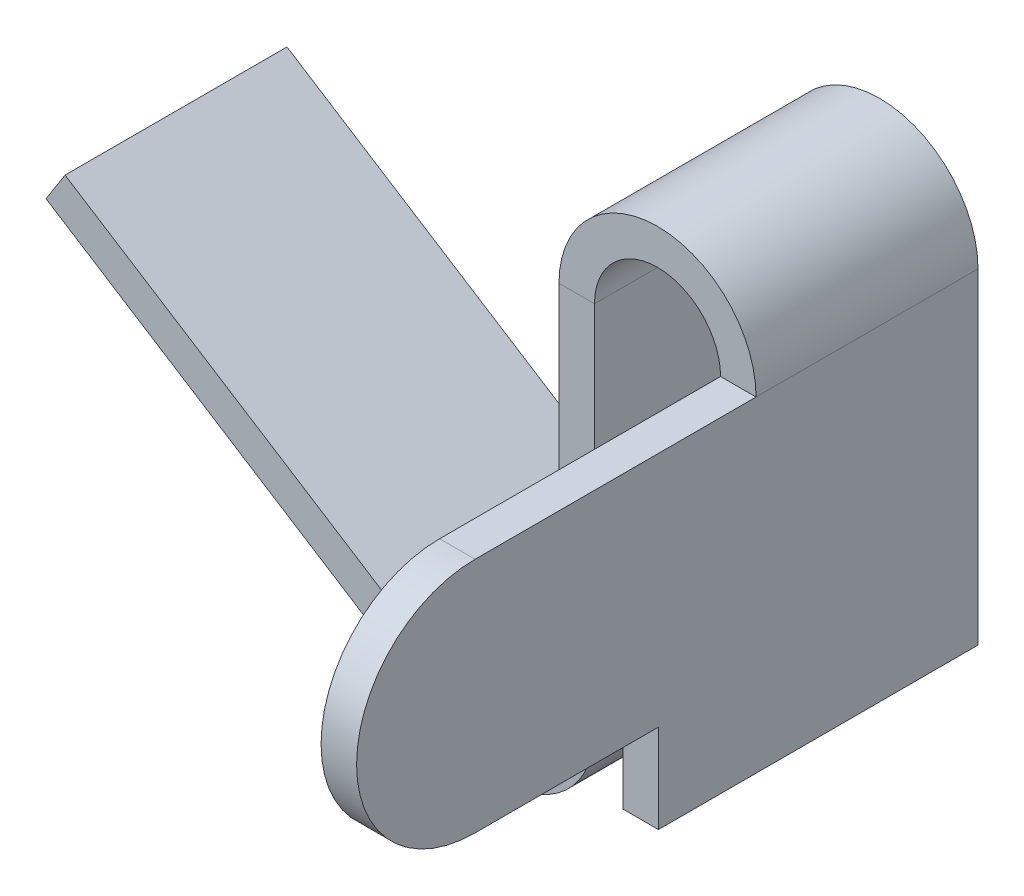
ISO-10303-21;
HEADER;
FILE_DESCRIPTION(('STEP AP214'),'2;1');
FILE_NAME('part.step','',(''),(''),'','','');
FILE_SCHEMA(('AUTOMOTIVE_DESIGN { 1 0 10303 214 1 1 1 1 }'));
ENDSEC;
DATA;
#1=APPLICATION_CONTEXT('core data for automotive mechanical design processes');
#2=APPLICATION_PROTOCOL_DEFINITION('international standard','automotive_design',2000,#1);
#3=PRODUCT_CONTEXT('',#1,'mechanical');
#4=PRODUCT('Part','Part','',(#3));
#5=PRODUCT_RELATED_PRODUCT_CATEGORY('part','',(#4));
#6=PRODUCT_DEFINITION_FORMATION('','',#4);
#7=PRODUCT_DEFINITION_CONTEXT('part definition',#1,'design');
#8=PRODUCT_DEFINITION('design','',#6,#7);
#9=PRODUCT_DEFINITION_SHAPE('','',#8);
#10=(LENGTH_UNIT() NAMED_UNIT(*) SI_UNIT(.MILLI.,.METRE.));
#11=(NAMED_UNIT(*) PLANE_ANGLE_UNIT() SI_UNIT($,.RADIAN.));
#12=(NAMED_UNIT(*) SI_UNIT($,.STERADIAN.) SOLID_ANGLE_UNIT());
#13=UNCERTAINTY_MEASURE_WITH_UNIT(LENGTH_MEASURE(1.E-05),#10,'distance_accuracy_value','');
#14=(GEOMETRIC_REPRESENTATION_CONTEXT(3) GLOBAL_UNCERTAINTY_ASSIGNED_CONTEXT((#13)) GLOBAL_UNIT_ASSIGNED_CONTEXT((#10,
#11,#12)) REPRESENTATION_CONTEXT('',''));
#15=CARTESIAN_POINT('',(0.,0.,0.));
#16=DIRECTION('',(0.,0.,1.));
#17=DIRECTION('',(1.,0.,0.));
#18=AXIS2_PLACEMENT_3D('',#15,#16,#17);
#19=CARTESIAN_POINT('',(1.11,0.5,5.665));
#20=DIRECTION('',(1.,0.,0.));
#21=DIRECTION('',(0.,1.,0.));
#22=AXIS2_PLACEMENT_3D('',#19,#20,#21);
#23=CYLINDRICAL_SURFACE('',#22,1.335);
#24=DIRECTION('',(-1.,0.,0.));
#25=VECTOR('',#24,1.);
#26=CARTESIAN_POINT('',(1.11,-0.835,5.665));
#27=LINE('',#26,#25);
#28=CARTESIAN_POINT('',(1.11,-0.835,5.665));
#29=VERTEX_POINT('',#28);
#30=CARTESIAN_POINT('',(0.71,-0.835,5.665));
#31=VERTEX_POINT('',#30);
#32=EDGE_CURVE('E212',#29,#31,#27,.T.);
#33=ORIENTED_EDGE('',*,*,#32,.F.);
#34=CARTESIAN_POINT('',(1.11,0.5,5.665));
#35=DIRECTION('',(-1.,0.,0.));
#36=DIRECTION('',(0.,-1.,0.));
#37=AXIS2_PLACEMENT_3D('',#34,#35,#36);
#38=CIRCLE('',#37,1.335);
#39=CARTESIAN_POINT('',(1.11,1.835,5.665));
#40=VERTEX_POINT('',#39);
#41=EDGE_CURVE('E55',#40,#29,#38,.F.);
#42=ORIENTED_EDGE('',*,*,#41,.F.);
#43=DIRECTION('',(-1.,0.,0.));
#44=VECTOR('',#43,1.);
#45=CARTESIAN_POINT('',(1.11,1.835,5.665));
#46=LINE('',#45,#44);
#47=CARTESIAN_POINT('',(0.709999999999999,1.835,5.665));
#48=VERTEX_POINT('',#47);
#49=EDGE_CURVE('E215',#48,#40,#46,.F.);
#50=ORIENTED_EDGE('',*,*,#49,.F.);
#51=CARTESIAN_POINT('',(0.709999999999999,0.5,5.665));
#52=DIRECTION('',(-1.,0.,0.));
#53=DIRECTION('',(0.,-1.,0.));
#54=AXIS2_PLACEMENT_3D('',#51,#52,#53);
#55=CIRCLE('',#54,1.335);
#56=EDGE_CURVE('E11',#31,#48,#55,.T.);
#57=ORIENTED_EDGE('',*,*,#56,.F.);
#58=EDGE_LOOP('',(#33,#42,#50,#57));
#59=FACE_BOUND('',#58,.T.);
#60=ADVANCED_FACE('F47',(#59),#23,.T.);
#61=CARTESIAN_POINT('',(-0.71,1.835,2.5));
#62=DIRECTION('',(0.,0.,1.));
#63=DIRECTION('',(1.,0.,0.));
#64=AXIS2_PLACEMENT_3D('',#61,#62,#63);
#65=PLANE('',#64);
#66=DIRECTION('',(-1.,0.,0.));
#67=VECTOR('',#66,1.);
#68=CARTESIAN_POINT('',(-0.71,1.835,2.5));
#69=LINE('',#68,#67);
#70=CARTESIAN_POINT('',(-0.71,1.835,2.5));
#71=VERTEX_POINT('',#70);
#72=CARTESIAN_POINT('',(-1.11,1.835,2.5));
#73=VERTEX_POINT('',#72);
#74=EDGE_CURVE('E210',#71,#73,#69,.T.);
#75=ORIENTED_EDGE('',*,*,#74,.F.);
#76=CARTESIAN_POINT('',(0.,1.835,2.5));
#77=DIRECTION('',(0.,0.,1.));
#78=DIRECTION('',(-1.,0.,0.));
#79=AXIS2_PLACEMENT_3D('',#76,#77,#78);
#80=CIRCLE('',#79,0.709999999999999);
#81=CARTESIAN_POINT('',(0.709999999999999,1.835,2.5));
#82=VERTEX_POINT('',#81);
#83=EDGE_CURVE('E250',#82,#71,#80,.T.);
#84=ORIENTED_EDGE('',*,*,#83,.F.);
#85=DIRECTION('',(-1.,0.,0.));
#86=VECTOR('',#85,1.);
#87=CARTESIAN_POINT('',(1.11,1.835,2.5));
#88=LINE('',#87,#86);
#89=CARTESIAN_POINT('',(1.11,1.835,2.5));
#90=VERTEX_POINT('',#89);
#91=EDGE_CURVE('E207',#90,#82,#88,.T.);
#92=ORIENTED_EDGE('',*,*,#91,.F.);
#93=CARTESIAN_POINT('',(0.,1.835,2.5));
#94=DIRECTION('',(0.,0.,1.));
#95=DIRECTION('',(1.,0.,0.));
#96=AXIS2_PLACEMENT_3D('',#93,#94,#95);
#97=CIRCLE('',#96,1.11);
#98=EDGE_CURVE('E253',#90,#73,#97,.T.);
#99=ORIENTED_EDGE('',*,*,#98,.T.);
#100=EDGE_LOOP('',(#75,#84,#92,#99));
#101=FACE_BOUND('',#100,.T.);
#102=ADVANCED_FACE('F356',(#101),#65,.T.);
#103=CARTESIAN_POINT('',(1.11,1.835,2.5));
#104=DIRECTION('',(0.,0.,1.));
#105=DIRECTION('',(1.,0.,0.));
#106=AXIS2_PLACEMENT_3D('',#103,#104,#105);
#107=PLANE('',#106);
#108=DIRECTION('',(0.,-1.,0.));
#109=VECTOR('',#108,1.);
#110=CARTESIAN_POINT('',(-0.709999999999999,-2.335,2.5));
#111=LINE('',#110,#109);
#112=CARTESIAN_POINT('',(-0.709999999999999,-2.335,2.5));
#113=VERTEX_POINT('',#112);
#114=EDGE_CURVE('E247',#71,#113,#111,.T.);
#115=ORIENTED_EDGE('',*,*,#114,.F.);
#116=ORIENTED_EDGE('',*,*,#74,.T.);
#117=DIRECTION('',(0.,-1.,0.));
#118=VECTOR('',#117,1.);
#119=CARTESIAN_POINT('',(-1.11,-1.835,2.5));
#120=LINE('',#119,#118);
#121=CARTESIAN_POINT('',(-1.11,-2.335,2.5));
#122=VERTEX_POINT('',#121);
#123=EDGE_CURVE('E256',#73,#122,#120,.T.);
#124=ORIENTED_EDGE('',*,*,#123,.T.);
#125=DIRECTION('',(1.,0.,0.));
#126=VECTOR('',#125,1.);
#127=CARTESIAN_POINT('',(-1.11,-2.335,2.5));
#128=LINE('',#127,#126);
#129=EDGE_CURVE('E199',#122,#113,#128,.T.);
#130=ORIENTED_EDGE('',*,*,#129,.T.);
#131=EDGE_LOOP('',(#115,#116,#124,#130));
#132=FACE_BOUND('',#131,.T.);
#133=ADVANCED_FACE('F351',(#132),#107,.T.);
#134=CARTESIAN_POINT('',(0.709999999999999,1.835,0.));
#135=DIRECTION('',(0.,0.,-1.));
#136=DIRECTION('',(-1.,0.,0.));
#137=AXIS2_PLACEMENT_3D('',#134,#135,#136);
#138=PLANE('',#137);
#139=DIRECTION('',(1.,0.,0.));
#140=VECTOR('',#139,1.);
#141=CARTESIAN_POINT('',(0.709999999999999,1.835,0.));
#142=LINE('',#141,#140);
#143=CARTESIAN_POINT('',(0.709999999999999,1.835,0.));
#144=VERTEX_POINT('',#143);
#145=CARTESIAN_POINT('',(1.11,1.835,0.));
#146=VERTEX_POINT('',#145);
#147=EDGE_CURVE('E205',#144,#146,#142,.T.);
#148=ORIENTED_EDGE('',*,*,#147,.F.);
#149=CARTESIAN_POINT('',(0.,1.835,0.));
#150=DIRECTION('',(0.,0.,1.));
#151=DIRECTION('',(-1.,0.,0.));
#152=AXIS2_PLACEMENT_3D('',#149,#150,#151);
#153=CIRCLE('',#152,0.709999999999999);
#154=CARTESIAN_POINT('',(-0.71,1.835,0.));
#155=VERTEX_POINT('',#154);
#156=EDGE_CURVE('E277',#144,#155,#153,.T.);
#157=ORIENTED_EDGE('',*,*,#156,.T.);
#158=DIRECTION('',(1.,0.,0.));
#159=VECTOR('',#158,1.);
#160=CARTESIAN_POINT('',(-1.11,1.835,0.));
#161=LINE('',#160,#159);
#162=CARTESIAN_POINT('',(-1.11,1.835,0.));
#163=VERTEX_POINT('',#162);
#164=EDGE_CURVE('E203',#163,#155,#161,.T.);
#165=ORIENTED_EDGE('',*,*,#164,.F.);
#166=CARTESIAN_POINT('',(0.,1.835,0.));
#167=DIRECTION('',(0.,0.,1.));
#168=DIRECTION('',(1.,0.,0.));
#169=AXIS2_PLACEMENT_3D('',#166,#167,#168);
#170=CIRCLE('',#169,1.11);
#171=EDGE_CURVE('E286',#146,#163,#170,.T.);
#172=ORIENTED_EDGE('',*,*,#171,.F.);
#173=EDGE_LOOP('',(#148,#157,#165,#172));
#174=FACE_BOUND('',#173,.T.);
#175=ADVANCED_FACE('F308',(#174),#138,.T.);
#176=CARTESIAN_POINT('',(-1.11,1.835,0.));
#177=DIRECTION('',(0.,0.,-1.));
#178=DIRECTION('',(-1.,0.,0.));
#179=AXIS2_PLACEMENT_3D('',#176,#177,#178);
#180=PLANE('',#179);
#181=DIRECTION('',(0.,1.,0.));
#182=VECTOR('',#181,1.);
#183=CARTESIAN_POINT('',(0.709999999999999,1.835,0.));
#184=LINE('',#183,#182);
#185=CARTESIAN_POINT('',(0.71,-1.835,0.));
#186=VERTEX_POINT('',#185);
#187=EDGE_CURVE('E173',#186,#144,#184,.T.);
#188=ORIENTED_EDGE('',*,*,#187,.T.);
#189=ORIENTED_EDGE('',*,*,#147,.T.);
#190=DIRECTION('',(0.,1.,0.));
#191=VECTOR('',#190,1.);
#192=CARTESIAN_POINT('',(1.11,1.835,0.));
#193=LINE('',#192,#191);
#194=CARTESIAN_POINT('',(1.11,-1.835,0.));
#195=VERTEX_POINT('',#194);
#196=EDGE_CURVE('E283',#195,#146,#193,.T.);
#197=ORIENTED_EDGE('',*,*,#196,.F.);
#198=DIRECTION('',(-1.,0.,0.));
#199=VECTOR('',#198,1.);
#200=CARTESIAN_POINT('',(1.11,-1.835,0.));
#201=LINE('',#200,#199);
#202=EDGE_CURVE('E281',#195,#186,#201,.T.);
#203=ORIENTED_EDGE('',*,*,#202,.T.);
#204=EDGE_LOOP('',(#188,#189,#197,#203));
#205=FACE_BOUND('',#204,.T.);
#206=ADVANCED_FACE('F365',(#205),#180,.T.);
#207=CARTESIAN_POINT('',(-2.24626881057681,-3.17904725152241,2.5));
#208=DIRECTION('',(0.,0.,1.));
#209=DIRECTION('',(1.,0.,0.));
#210=AXIS2_PLACEMENT_3D('',#207,#208,#209);
#211=PLANE('',#210);
#212=DIRECTION('',(0.536268810576813,0.844047251522407,0.));
#213=VECTOR('',#212,1.);
#214=CARTESIAN_POINT('',(-2.24626881057681,-3.17904725152241,2.5));
#215=LINE('',#214,#213);
#216=CARTESIAN_POINT('',(-2.24626881057681,-3.17904725152241,2.5));
#217=VERTEX_POINT('',#216);
#218=CARTESIAN_POINT('',(-2.03176128634609,-2.84142835091345,2.5));
#219=VERTEX_POINT('',#218);
#220=EDGE_CURVE('E201',#217,#219,#215,.T.);
#221=ORIENTED_EDGE('',*,*,#220,.F.);
#222=CARTESIAN_POINT('',(-1.71,-2.335,2.5));
#223=DIRECTION('',(0.,0.,-1.));
#224=DIRECTION('',(-1.,0.,0.));
#225=AXIS2_PLACEMENT_3D('',#222,#223,#224);
#226=CIRCLE('',#225,1.);
#227=EDGE_CURVE('E244',#113,#217,#226,.T.);
#228=ORIENTED_EDGE('',*,*,#227,.F.);
#229=ORIENTED_EDGE('',*,*,#129,.F.);
#230=CARTESIAN_POINT('',(-1.71,-2.335,2.5));
#231=DIRECTION('',(0.,0.,1.));
#232=DIRECTION('',(1.,0.,0.));
#233=AXIS2_PLACEMENT_3D('',#230,#231,#232);
#234=CIRCLE('',#233,0.6);
#235=EDGE_CURVE('E259',#122,#219,#234,.F.);
#236=ORIENTED_EDGE('',*,*,#235,.T.);
#237=EDGE_LOOP('',(#221,#228,#229,#236));
#238=FACE_BOUND('',#237,.T.);
#239=ADVANCED_FACE('F348',(#238),#211,.T.);
#240=CARTESIAN_POINT('',(-1.11,-2.335,2.5));
#241=DIRECTION('',(0.,0.,1.));
#242=DIRECTION('',(1.,0.,0.));
#243=AXIS2_PLACEMENT_3D('',#240,#241,#242);
#244=PLANE('',#243);
#245=DIRECTION('',(-0.844047251522408,0.536268810576813,0.));
#246=VECTOR('',#245,1.);
#247=CARTESIAN_POINT('',(-2.24626881057681,-3.17904725152241,2.5));
#248=LINE('',#247,#246);
#249=CARTESIAN_POINT('',(-6.88852869395005,-0.229568793349937,2.5));
#250=VERTEX_POINT('',#249);
#251=EDGE_CURVE('E241',#217,#250,#248,.T.);
#252=ORIENTED_EDGE('',*,*,#251,.F.);
#253=ORIENTED_EDGE('',*,*,#220,.T.);
#254=DIRECTION('',(-0.844047251522408,0.536268810576813,0.));
#255=VECTOR('',#254,1.);
#256=CARTESIAN_POINT('',(-2.03176128634609,-2.84142835091344,2.5));
#257=LINE('',#256,#255);
#258=CARTESIAN_POINT('',(-6.67402116971933,0.108050107259026,2.5));
#259=VERTEX_POINT('',#258);
#260=EDGE_CURVE('E235',#219,#259,#257,.T.);
#261=ORIENTED_EDGE('',*,*,#260,.T.);
#262=DIRECTION('',(0.536268810576814,0.844047251522407,0.));
#263=VECTOR('',#262,1.);
#264=CARTESIAN_POINT('',(-6.88852869395005,-0.229568793349937,2.5));
#265=LINE('',#264,#263);
#266=EDGE_CURVE('E237',#250,#259,#265,.T.);
#267=ORIENTED_EDGE('',*,*,#266,.F.);
#268=EDGE_LOOP('',(#252,#253,#261,#267));
#269=FACE_BOUND('',#268,.T.);
#270=ADVANCED_FACE('F346',(#269),#244,.T.);
#271=CARTESIAN_POINT('',(-0.709999999999999,-2.335,0.));
#272=DIRECTION('',(0.,0.,-1.));
#273=DIRECTION('',(-1.,0.,0.));
#274=AXIS2_PLACEMENT_3D('',#271,#272,#273);
#275=PLANE('',#274);
#276=DIRECTION('',(-1.,0.,0.));
#277=VECTOR('',#276,1.);
#278=CARTESIAN_POINT('',(-0.709999999999999,-2.335,0.));
#279=LINE('',#278,#277);
#280=CARTESIAN_POINT('',(-0.709999999999999,-2.335,0.));
#281=VERTEX_POINT('',#280);
#282=CARTESIAN_POINT('',(-1.11,-2.335,0.));
#283=VERTEX_POINT('',#282);
#284=EDGE_CURVE('E197',#281,#283,#279,.T.);
#285=ORIENTED_EDGE('',*,*,#284,.F.);
#286=CARTESIAN_POINT('',(-1.71,-2.335,0.));
#287=DIRECTION('',(0.,0.,-1.));
#288=DIRECTION('',(-1.,0.,0.));
#289=AXIS2_PLACEMENT_3D('',#286,#287,#288);
#290=CIRCLE('',#289,1.);
#291=CARTESIAN_POINT('',(-2.24626881057681,-3.17904725152241,0.));
#292=VERTEX_POINT('',#291);
#293=EDGE_CURVE('E271',#281,#292,#290,.T.);
#294=ORIENTED_EDGE('',*,*,#293,.T.);
#295=DIRECTION('',(-0.536268810576813,-0.844047251522407,0.));
#296=VECTOR('',#295,1.);
#297=CARTESIAN_POINT('',(-2.03176128634609,-2.84142835091345,0.));
#298=LINE('',#297,#296);
#299=CARTESIAN_POINT('',(-2.03176128634609,-2.84142835091345,0.));
#300=VERTEX_POINT('',#299);
#301=EDGE_CURVE('E195',#300,#292,#298,.T.);
#302=ORIENTED_EDGE('',*,*,#301,.F.);
#303=CARTESIAN_POINT('',(-1.71,-2.335,0.));
#304=DIRECTION('',(0.,0.,1.));
#305=DIRECTION('',(1.,0.,0.));
#306=AXIS2_PLACEMENT_3D('',#303,#304,#305);
#307=CIRCLE('',#306,0.6);
#308=EDGE_CURVE('E238',#283,#300,#307,.F.);
#309=ORIENTED_EDGE('',*,*,#308,.F.);
#310=EDGE_LOOP('',(#285,#294,#302,#309));
#311=FACE_BOUND('',#310,.T.);
#312=ADVANCED_FACE('F323',(#311),#275,.T.);
#313=CARTESIAN_POINT('',(-2.03176128634609,-2.84142835091345,0.));
#314=DIRECTION('',(0.,0.,-1.));
#315=DIRECTION('',(-1.,0.,0.));
#316=AXIS2_PLACEMENT_3D('',#313,#314,#315);
#317=PLANE('',#316);
#318=DIRECTION('',(0.,-1.,0.));
#319=VECTOR('',#318,1.);
#320=CARTESIAN_POINT('',(-0.709999999999999,-1.835,0.));
#321=LINE('',#320,#319);
#322=EDGE_CURVE('E274',#155,#281,#321,.T.);
#323=ORIENTED_EDGE('',*,*,#322,.T.);
#324=ORIENTED_EDGE('',*,*,#284,.T.);
#325=DIRECTION('',(0.,1.,0.));
#326=VECTOR('',#325,1.);
#327=CARTESIAN_POINT('',(-1.11,-2.335,0.));
#328=LINE('',#327,#326);
#329=EDGE_CURVE('E289',#163,#283,#328,.F.);
#330=ORIENTED_EDGE('',*,*,#329,.F.);
#331=ORIENTED_EDGE('',*,*,#164,.T.);
#332=EDGE_LOOP('',(#323,#324,#330,#331));
#333=FACE_BOUND('',#332,.T.);
#334=ADVANCED_FACE('F312',(#333),#317,.T.);
#335=CARTESIAN_POINT('',(-2.03176128634609,-2.84142835091344,2.5));
#336=DIRECTION('',(-0.536268810576813,-0.844047251522408,0.));
#337=DIRECTION('',(0.844047251522408,-0.536268810576813,0.));
#338=AXIS2_PLACEMENT_3D('',#335,#336,#337);
#339=PLANE('',#338);
#340=DIRECTION('',(-0.844047251522408,0.536268810576813,0.));
#341=VECTOR('',#340,1.);
#342=CARTESIAN_POINT('',(-2.03176128634609,-2.84142835091344,0.));
#343=LINE('',#342,#341);
#344=CARTESIAN_POINT('',(-6.67402116971933,0.108050107259026,0.));
#345=VERTEX_POINT('',#344);
#346=EDGE_CURVE('E234',#300,#345,#343,.T.);
#347=ORIENTED_EDGE('',*,*,#346,.T.);
#348=DIRECTION('',(0.,0.,-1.));
#349=VECTOR('',#348,1.);
#350=CARTESIAN_POINT('',(-6.67402116971933,0.108050107259026,2.5));
#351=LINE('',#350,#349);
#352=EDGE_CURVE('E193',#259,#345,#351,.T.);
#353=ORIENTED_EDGE('',*,*,#352,.F.);
#354=ORIENTED_EDGE('',*,*,#260,.F.);
#355=DIRECTION('',(0.,0.,-1.));
#356=VECTOR('',#355,1.);
#357=CARTESIAN_POINT('',(-2.03176128634609,-2.84142835091345,2.5));
#358=LINE('',#357,#356);
#359=EDGE_CURVE('E262',#219,#300,#358,.T.);
#360=ORIENTED_EDGE('',*,*,#359,.T.);
#361=EDGE_LOOP('',(#347,#353,#354,#360));
#362=FACE_BOUND('',#361,.T.);
#363=ADVANCED_FACE('F344',(#362),#339,.F.);
#364=CARTESIAN_POINT('',(-6.88852869395005,-0.229568793349937,2.5));
#365=DIRECTION('',(-0.844047251522407,0.536268810576814,0.));
#366=DIRECTION('',(-0.536268810576814,-0.844047251522407,0.));
#367=AXIS2_PLACEMENT_3D('',#364,#365,#366);
#368=PLANE('',#367);
#369=DIRECTION('',(0.536268810576814,0.844047251522407,0.));
#370=VECTOR('',#369,1.);
#371=CARTESIAN_POINT('',(-6.88852869395005,-0.229568793349937,0.));
#372=LINE('',#371,#370);
#373=CARTESIAN_POINT('',(-6.88852869395005,-0.229568793349937,0.));
#374=VERTEX_POINT('',#373);
#375=EDGE_CURVE('E265',#374,#345,#372,.T.);
#376=ORIENTED_EDGE('',*,*,#375,.F.);
#377=DIRECTION('',(0.,0.,-1.));
#378=VECTOR('',#377,1.);
#379=CARTESIAN_POINT('',(-6.88852869395005,-0.229568793349937,2.5));
#380=LINE('',#379,#378);
#381=EDGE_CURVE('E191',#250,#374,#380,.T.);
#382=ORIENTED_EDGE('',*,*,#381,.F.);
#383=ORIENTED_EDGE('',*,*,#266,.T.);
#384=ORIENTED_EDGE('',*,*,#352,.T.);
#385=EDGE_LOOP('',(#376,#382,#383,#384));
#386=FACE_BOUND('',#385,.T.);
#387=ADVANCED_FACE('F340',(#386),#368,.T.);
#388=CARTESIAN_POINT('',(-2.24626881057681,-3.17904725152241,2.5));
#389=DIRECTION('',(-0.536268810576813,-0.844047251522408,0.));
#390=DIRECTION('',(0.844047251522408,-0.536268810576813,0.));
#391=AXIS2_PLACEMENT_3D('',#388,#389,#390);
#392=PLANE('',#391);
#393=DIRECTION('',(-0.844047251522408,0.536268810576813,0.));
#394=VECTOR('',#393,1.);
#395=CARTESIAN_POINT('',(-2.24626881057681,-3.17904725152241,0.));
#396=LINE('',#395,#394);
#397=EDGE_CURVE('E268',#292,#374,#396,.T.);
#398=ORIENTED_EDGE('',*,*,#397,.F.);
#399=DIRECTION('',(0.,0.,-1.));
#400=VECTOR('',#399,1.);
#401=CARTESIAN_POINT('',(-2.24626881057681,-3.17904725152241,2.5));
#402=LINE('',#401,#400);
#403=EDGE_CURVE('E188',#217,#292,#402,.T.);
#404=ORIENTED_EDGE('',*,*,#403,.F.);
#405=ORIENTED_EDGE('',*,*,#251,.T.);
#406=ORIENTED_EDGE('',*,*,#381,.T.);
#407=EDGE_LOOP('',(#398,#404,#405,#406));
#408=FACE_BOUND('',#407,.T.);
#409=ADVANCED_FACE('F336',(#408),#392,.T.);
#410=CARTESIAN_POINT('',(-1.71,-2.335,2.5));
#411=DIRECTION('',(0.,0.,-1.));
#412=DIRECTION('',(-1.,0.,0.));
#413=AXIS2_PLACEMENT_3D('',#410,#411,#412);
#414=CYLINDRICAL_SURFACE('',#413,1.);
#415=ORIENTED_EDGE('',*,*,#293,.F.);
#416=DIRECTION('',(0.,0.,-1.));
#417=VECTOR('',#416,1.);
#418=CARTESIAN_POINT('',(-0.709999999999999,-2.335,2.5));
#419=LINE('',#418,#417);
#420=EDGE_CURVE('E185',#113,#281,#419,.T.);
#421=ORIENTED_EDGE('',*,*,#420,.F.);
#422=ORIENTED_EDGE('',*,*,#227,.T.);
#423=ORIENTED_EDGE('',*,*,#403,.T.);
#424=EDGE_LOOP('',(#415,#421,#422,#423));
#425=FACE_BOUND('',#424,.T.);
#426=ADVANCED_FACE('F331',(#425),#414,.T.);
#427=CARTESIAN_POINT('',(-0.709999999999999,-1.835,2.5));
#428=DIRECTION('',(1.,0.,0.));
#429=DIRECTION('',(0.,1.,0.));
#430=AXIS2_PLACEMENT_3D('',#427,#428,#429);
#431=PLANE('',#430);
#432=ORIENTED_EDGE('',*,*,#322,.F.);
#433=DIRECTION('',(0.,0.,-1.));
#434=VECTOR('',#433,1.);
#435=CARTESIAN_POINT('',(-0.71,1.835,2.5));
#436=LINE('',#435,#434);
#437=EDGE_CURVE('E177',#71,#155,#436,.T.);
#438=ORIENTED_EDGE('',*,*,#437,.F.);
#439=ORIENTED_EDGE('',*,*,#114,.T.);
#440=ORIENTED_EDGE('',*,*,#420,.T.);
#441=EDGE_LOOP('',(#432,#438,#439,#440));
#442=FACE_BOUND('',#441,.T.);
#443=ADVANCED_FACE('F471',(#442),#431,.T.);
#444=CARTESIAN_POINT('',(0.,1.835,2.5));
#445=DIRECTION('',(0.,0.,-1.));
#446=DIRECTION('',(-1.,0.,0.));
#447=AXIS2_PLACEMENT_3D('',#444,#445,#446);
#448=CYLINDRICAL_SURFACE('',#447,0.709999999999999);
#449=ORIENTED_EDGE('',*,*,#156,.F.);
#450=DIRECTION('',(0.,0.,-1.));
#451=VECTOR('',#450,1.);
#452=CARTESIAN_POINT('',(0.709999999999999,1.835,2.5));
#453=LINE('',#452,#451);
#454=EDGE_CURVE('E175',#82,#144,#453,.T.);
#455=ORIENTED_EDGE('',*,*,#454,.F.);
#456=ORIENTED_EDGE('',*,*,#83,.T.);
#457=ORIENTED_EDGE('',*,*,#437,.T.);
#458=EDGE_LOOP('',(#449,#455,#456,#457));
#459=FACE_BOUND('',#458,.T.);
#460=ADVANCED_FACE('F362',(#459),#448,.F.);
#461=CARTESIAN_POINT('',(0.709999999999999,1.835,2.5));
#462=DIRECTION('',(-1.,0.,0.));
#463=DIRECTION('',(0.,-1.,0.));
#464=AXIS2_PLACEMENT_3D('',#461,#462,#463);
#465=PLANE('',#464);
#466=DIRECTION('',(0.,0.,1.));
#467=VECTOR('',#466,1.);
#468=CARTESIAN_POINT('',(0.71,-0.835,7.));
#469=LINE('',#468,#467);
#470=CARTESIAN_POINT('',(0.71,-0.835,3.6));
#471=VERTEX_POINT('',#470);
#472=EDGE_CURVE('E159',#471,#31,#469,.T.);
#473=ORIENTED_EDGE('',*,*,#472,.T.);
#474=ORIENTED_EDGE('',*,*,#56,.T.);
#475=DIRECTION('',(0.,0.,-1.));
#476=VECTOR('',#475,1.);
#477=CARTESIAN_POINT('',(0.709999999999999,1.835,7.));
#478=LINE('',#477,#476);
#479=EDGE_CURVE('E230',#48,#82,#478,.T.);
#480=ORIENTED_EDGE('',*,*,#479,.T.);
#481=ORIENTED_EDGE('',*,*,#454,.T.);
#482=ORIENTED_EDGE('',*,*,#187,.F.);
#483=DIRECTION('',(0.,0.,-1.));
#484=VECTOR('',#483,1.);
#485=CARTESIAN_POINT('',(0.71,-1.835,2.5));
#486=LINE('',#485,#484);
#487=CARTESIAN_POINT('',(0.71,-1.835,3.6));
#488=VERTEX_POINT('',#487);
#489=EDGE_CURVE('E166',#488,#186,#486,.T.);
#490=ORIENTED_EDGE('',*,*,#489,.F.);
#491=DIRECTION('',(0.,1.,0.));
#492=VECTOR('',#491,1.);
#493=CARTESIAN_POINT('',(0.71,-1.835,3.6));
#494=LINE('',#493,#492);
#495=EDGE_CURVE('E150',#488,#471,#494,.T.);
#496=ORIENTED_EDGE('',*,*,#495,.T.);
#497=EDGE_LOOP('',(#473,#474,#480,#481,#482,#490,#496));
#498=FACE_BOUND('',#497,.T.);
#499=ADVANCED_FACE('F170',(#498),#465,.T.);
#500=CARTESIAN_POINT('',(1.11,-1.835,2.5));
#501=DIRECTION('',(0.,-1.,0.));
#502=DIRECTION('',(1.,0.,0.));
#503=AXIS2_PLACEMENT_3D('',#500,#501,#502);
#504=PLANE('',#503);
#505=DIRECTION('',(1.,0.,0.));
#506=VECTOR('',#505,1.);
#507=CARTESIAN_POINT('',(0.71,-1.835,3.6));
#508=LINE('',#507,#506);
#509=CARTESIAN_POINT('',(1.11,-1.835,3.6));
#510=VERTEX_POINT('',#509);
#511=EDGE_CURVE('E154',#488,#510,#508,.T.);
#512=ORIENTED_EDGE('',*,*,#511,.F.);
#513=ORIENTED_EDGE('',*,*,#489,.T.);
#514=ORIENTED_EDGE('',*,*,#202,.F.);
#515=DIRECTION('',(0.,0.,-1.));
#516=VECTOR('',#515,1.);
#517=CARTESIAN_POINT('',(1.11,-1.835,2.5));
#518=LINE('',#517,#516);
#519=EDGE_CURVE('E168',#510,#195,#518,.T.);
#520=ORIENTED_EDGE('',*,*,#519,.F.);
#521=EDGE_LOOP('',(#512,#513,#514,#520));
#522=FACE_BOUND('',#521,.T.);
#523=ADVANCED_FACE('F164',(#522),#504,.T.);
#524=CARTESIAN_POINT('',(1.11,1.835,2.5));
#525=DIRECTION('',(-1.,0.,0.));
#526=DIRECTION('',(0.,-1.,0.));
#527=AXIS2_PLACEMENT_3D('',#524,#525,#526);
#528=PLANE('',#527);
#529=DIRECTION('',(0.,0.,-1.));
#530=VECTOR('',#529,1.);
#531=CARTESIAN_POINT('',(1.11,1.835,7.));
#532=LINE('',#531,#530);
#533=EDGE_CURVE('E222',#40,#90,#532,.T.);
#534=ORIENTED_EDGE('',*,*,#533,.F.);
#535=ORIENTED_EDGE('',*,*,#41,.T.);
#536=DIRECTION('',(0.,0.,1.));
#537=VECTOR('',#536,1.);
#538=CARTESIAN_POINT('',(1.11,-0.835,7.));
#539=LINE('',#538,#537);
#540=CARTESIAN_POINT('',(1.11,-0.835,3.6));
#541=VERTEX_POINT('',#540);
#542=EDGE_CURVE('E160',#541,#29,#539,.T.);
#543=ORIENTED_EDGE('',*,*,#542,.F.);
#544=DIRECTION('',(0.,1.,0.));
#545=VECTOR('',#544,1.);
#546=CARTESIAN_POINT('',(1.11,-1.835,3.6));
#547=LINE('',#546,#545);
#548=EDGE_CURVE('E225',#510,#541,#547,.T.);
#549=ORIENTED_EDGE('',*,*,#548,.F.);
#550=ORIENTED_EDGE('',*,*,#519,.T.);
#551=ORIENTED_EDGE('',*,*,#196,.T.);
#552=DIRECTION('',(0.,0.,-1.));
#553=VECTOR('',#552,1.);
#554=CARTESIAN_POINT('',(1.11,1.835,2.5));
#555=LINE('',#554,#553);
#556=EDGE_CURVE('E179',#90,#146,#555,.T.);
#557=ORIENTED_EDGE('',*,*,#556,.F.);
#558=EDGE_LOOP('',(#534,#535,#543,#549,#550,#551,#557));
#559=FACE_BOUND('',#558,.T.);
#560=ADVANCED_FACE('F219',(#559),#528,.F.);
#561=CARTESIAN_POINT('',(0.,1.835,2.5));
#562=DIRECTION('',(0.,0.,-1.));
#563=DIRECTION('',(-1.,0.,0.));
#564=AXIS2_PLACEMENT_3D('',#561,#562,#563);
#565=CYLINDRICAL_SURFACE('',#564,1.11);
#566=ORIENTED_EDGE('',*,*,#171,.T.);
#567=DIRECTION('',(0.,0.,-1.));
#568=VECTOR('',#567,1.);
#569=CARTESIAN_POINT('',(-1.11,1.835,2.5));
#570=LINE('',#569,#568);
#571=EDGE_CURVE('E299',#73,#163,#570,.T.);
#572=ORIENTED_EDGE('',*,*,#571,.F.);
#573=ORIENTED_EDGE('',*,*,#98,.F.);
#574=ORIENTED_EDGE('',*,*,#556,.T.);
#575=EDGE_LOOP('',(#566,#572,#573,#574));
#576=FACE_BOUND('',#575,.T.);
#577=ADVANCED_FACE('F305',(#576),#565,.T.);
#578=CARTESIAN_POINT('',(-1.11,-2.335,2.5));
#579=DIRECTION('',(1.,0.,0.));
#580=DIRECTION('',(0.,0.,-1.));
#581=AXIS2_PLACEMENT_3D('',#578,#579,#580);
#582=PLANE('',#581);
#583=ORIENTED_EDGE('',*,*,#329,.T.);
#584=DIRECTION('',(0.,0.,-1.));
#585=VECTOR('',#584,1.);
#586=CARTESIAN_POINT('',(-1.11,-2.335,2.5));
#587=LINE('',#586,#585);
#588=EDGE_CURVE('E296',#122,#283,#587,.T.);
#589=ORIENTED_EDGE('',*,*,#588,.F.);
#590=ORIENTED_EDGE('',*,*,#123,.F.);
#591=ORIENTED_EDGE('',*,*,#571,.T.);
#592=EDGE_LOOP('',(#583,#589,#590,#591));
#593=FACE_BOUND('',#592,.T.);
#594=ADVANCED_FACE('F315',(#593),#582,.F.);
#595=CARTESIAN_POINT('',(-1.71,-2.335,2.5));
#596=DIRECTION('',(0.,0.,-1.));
#597=DIRECTION('',(-1.,0.,0.));
#598=AXIS2_PLACEMENT_3D('',#595,#596,#597);
#599=CYLINDRICAL_SURFACE('',#598,0.6);
#600=ORIENTED_EDGE('',*,*,#308,.T.);
#601=ORIENTED_EDGE('',*,*,#359,.F.);
#602=ORIENTED_EDGE('',*,*,#235,.F.);
#603=ORIENTED_EDGE('',*,*,#588,.T.);
#604=EDGE_LOOP('',(#600,#601,#602,#603));
#605=FACE_BOUND('',#604,.T.);
#606=ADVANCED_FACE('F320',(#605),#599,.F.);
#607=CARTESIAN_POINT('',(-1.71,-2.335,0.));
#608=DIRECTION('',(0.,0.,-1.));
#609=DIRECTION('',(-1.,0.,0.));
#610=AXIS2_PLACEMENT_3D('',#607,#608,#609);
#611=PLANE('',#610);
#612=ORIENTED_EDGE('',*,*,#346,.F.);
#613=ORIENTED_EDGE('',*,*,#301,.T.);
#614=ORIENTED_EDGE('',*,*,#397,.T.);
#615=ORIENTED_EDGE('',*,*,#375,.T.);
#616=EDGE_LOOP('',(#612,#613,#614,#615));
#617=FACE_BOUND('',#616,.T.);
#618=ADVANCED_FACE('F327',(#617),#611,.T.);
#619=CARTESIAN_POINT('',(1.11,1.835,7.));
#620=DIRECTION('',(0.,-1.,0.));
#621=DIRECTION('',(1.,0.,0.));
#622=AXIS2_PLACEMENT_3D('',#619,#620,#621);
#623=PLANE('',#622);
#624=ORIENTED_EDGE('',*,*,#479,.F.);
#625=ORIENTED_EDGE('',*,*,#49,.T.);
#626=ORIENTED_EDGE('',*,*,#533,.T.);
#627=ORIENTED_EDGE('',*,*,#91,.T.);
#628=EDGE_LOOP('',(#624,#625,#626,#627));
#629=FACE_BOUND('',#628,.T.);
#630=ADVANCED_FACE('F360',(#629),#623,.F.);
#631=CARTESIAN_POINT('',(0.71,-0.835,7.));
#632=DIRECTION('',(0.,1.,0.));
#633=DIRECTION('',(-1.,0.,0.));
#634=AXIS2_PLACEMENT_3D('',#631,#632,#633);
#635=PLANE('',#634);
#636=ORIENTED_EDGE('',*,*,#542,.T.);
#637=ORIENTED_EDGE('',*,*,#32,.T.);
#638=ORIENTED_EDGE('',*,*,#472,.F.);
#639=DIRECTION('',(1.,0.,0.));
#640=VECTOR('',#639,1.);
#641=CARTESIAN_POINT('',(0.71,-0.835,3.6));
#642=LINE('',#641,#640);
#643=EDGE_CURVE('E156',#471,#541,#642,.T.);
#644=ORIENTED_EDGE('',*,*,#643,.T.);
#645=EDGE_LOOP('',(#636,#637,#638,#644));
#646=FACE_BOUND('',#645,.T.);
#647=ADVANCED_FACE('F224',(#646),#635,.F.);
#648=CARTESIAN_POINT('',(0.71,-1.835,3.6));
#649=DIRECTION('',(0.,0.,-1.));
#650=DIRECTION('',(-1.,0.,0.));
#651=AXIS2_PLACEMENT_3D('',#648,#649,#650);
#652=PLANE('',#651);
#653=ORIENTED_EDGE('',*,*,#548,.T.);
#654=ORIENTED_EDGE('',*,*,#643,.F.);
#655=ORIENTED_EDGE('',*,*,#495,.F.);
#656=ORIENTED_EDGE('',*,*,#511,.T.);
#657=EDGE_LOOP('',(#653,#654,#655,#656));
#658=FACE_BOUND('',#657,.T.);
#659=ADVANCED_FACE('F153',(#658),#652,.F.);
#660=CLOSED_SHELL('',(#60,#102,#133,#175,#206,#239,#270,#312,#334,#363,#387,#409,#426,#443,#460,
#499,#523,#560,#577,#594,#606,#618,#630,#647,#659));
#661=MANIFOLD_SOLID_BREP('B2',#660);
#662=ADVANCED_BREP_SHAPE_REPRESENTATION('',(#18,#661),#14);
#663=SHAPE_DEFINITION_REPRESENTATION(#9,#662);
ENDSEC;
END-ISO-10303-21;
